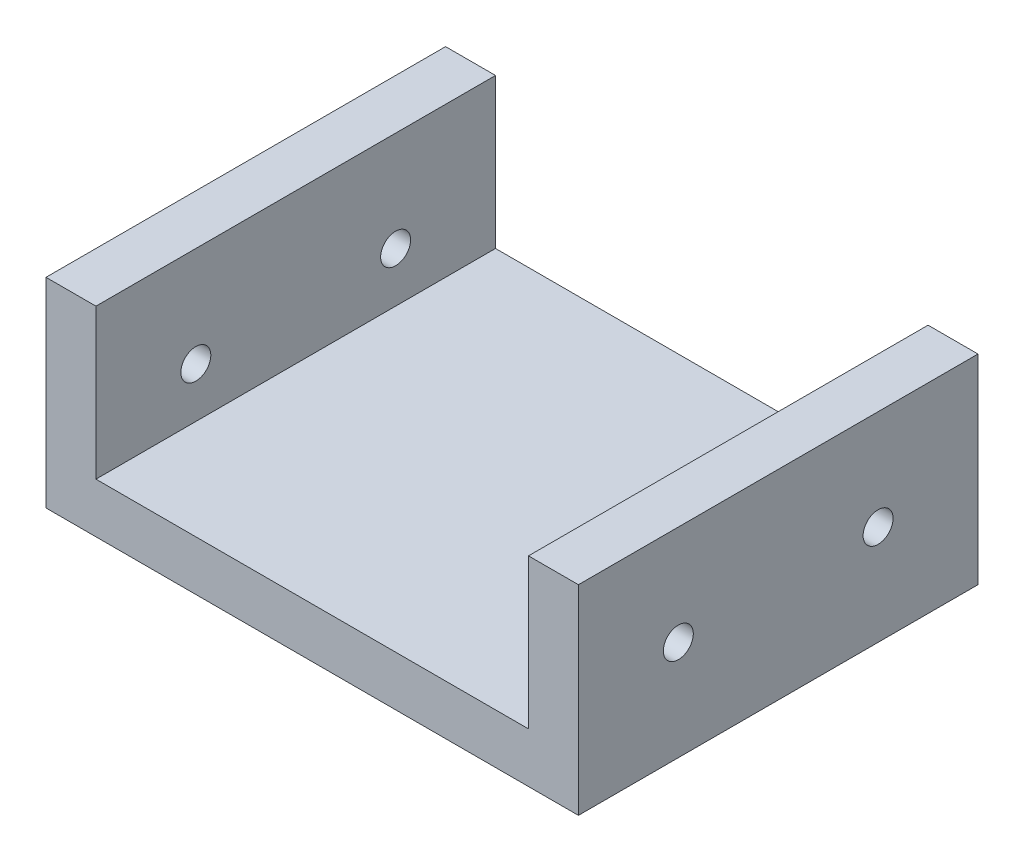
ISO-10303-21;
HEADER;
FILE_DESCRIPTION(('STEP AP214'),'2;1');
FILE_NAME('part.step','',(''),(''),'','','');
FILE_SCHEMA(('AUTOMOTIVE_DESIGN { 1 0 10303 214 1 1 1 1 }'));
ENDSEC;
DATA;
#1=APPLICATION_CONTEXT('core data for automotive mechanical design processes');
#2=APPLICATION_PROTOCOL_DEFINITION('international standard','automotive_design',2000,#1);
#3=PRODUCT_CONTEXT('',#1,'mechanical');
#4=PRODUCT('Part','Part','',(#3));
#5=PRODUCT_RELATED_PRODUCT_CATEGORY('part','',(#4));
#6=PRODUCT_DEFINITION_FORMATION('','',#4);
#7=PRODUCT_DEFINITION_CONTEXT('part definition',#1,'design');
#8=PRODUCT_DEFINITION('design','',#6,#7);
#9=PRODUCT_DEFINITION_SHAPE('','',#8);
#10=(LENGTH_UNIT() NAMED_UNIT(*) SI_UNIT(.MILLI.,.METRE.));
#11=(NAMED_UNIT(*) PLANE_ANGLE_UNIT() SI_UNIT($,.RADIAN.));
#12=(NAMED_UNIT(*) SI_UNIT($,.STERADIAN.) SOLID_ANGLE_UNIT());
#13=UNCERTAINTY_MEASURE_WITH_UNIT(LENGTH_MEASURE(1.E-05),#10,'distance_accuracy_value','');
#14=(GEOMETRIC_REPRESENTATION_CONTEXT(3) GLOBAL_UNCERTAINTY_ASSIGNED_CONTEXT((#13)) GLOBAL_UNIT_ASSIGNED_CONTEXT((#10,
#11,#12)) REPRESENTATION_CONTEXT('',''));
#15=CARTESIAN_POINT('',(0.,0.,0.));
#16=DIRECTION('',(0.,0.,1.));
#17=DIRECTION('',(1.,0.,0.));
#18=AXIS2_PLACEMENT_3D('',#15,#16,#17);
#19=CARTESIAN_POINT('',(0.,20.,0.));
#20=DIRECTION('',(0.,1.,0.));
#21=DIRECTION('',(0.,0.,1.));
#22=AXIS2_PLACEMENT_3D('',#19,#20,#21);
#23=PLANE('',#22);
#24=DIRECTION('',(0.,0.,1.));
#25=VECTOR('',#24,1.);
#26=CARTESIAN_POINT('',(5.,20.,0.));
#27=LINE('',#26,#25);
#28=CARTESIAN_POINT('',(5.,20.,0.));
#29=VERTEX_POINT('',#28);
#30=CARTESIAN_POINT('',(5.,20.,40.));
#31=VERTEX_POINT('',#30);
#32=EDGE_CURVE('E122',#29,#31,#27,.T.);
#33=ORIENTED_EDGE('',*,*,#32,.F.);
#34=DIRECTION('',(-1.,0.,0.));
#35=VECTOR('',#34,1.);
#36=CARTESIAN_POINT('',(0.,20.,0.));
#37=LINE('',#36,#35);
#38=CARTESIAN_POINT('',(0.,20.,0.));
#39=VERTEX_POINT('',#38);
#40=EDGE_CURVE('E67',#29,#39,#37,.T.);
#41=ORIENTED_EDGE('',*,*,#40,.T.);
#42=DIRECTION('',(0.,0.,1.));
#43=VECTOR('',#42,1.);
#44=CARTESIAN_POINT('',(0.,20.,0.));
#45=LINE('',#44,#43);
#46=CARTESIAN_POINT('',(0.,20.,40.));
#47=VERTEX_POINT('',#46);
#48=EDGE_CURVE('E153',#39,#47,#45,.T.);
#49=ORIENTED_EDGE('',*,*,#48,.T.);
#50=DIRECTION('',(1.,0.,0.));
#51=VECTOR('',#50,1.);
#52=CARTESIAN_POINT('',(0.,20.,40.));
#53=LINE('',#52,#51);
#54=EDGE_CURVE('E96',#47,#31,#53,.T.);
#55=ORIENTED_EDGE('',*,*,#54,.T.);
#56=EDGE_LOOP('',(#33,#41,#49,#55));
#57=FACE_BOUND('',#56,.T.);
#58=ADVANCED_FACE('F41',(#57),#23,.T.);
#59=CARTESIAN_POINT('',(0.,20.,0.));
#60=DIRECTION('',(1.,0.,0.));
#61=DIRECTION('',(0.,0.,-1.));
#62=AXIS2_PLACEMENT_3D('',#59,#60,#61);
#63=PLANE('',#62);
#64=CARTESIAN_POINT('',(0.,10.,30.));
#65=DIRECTION('',(1.,0.,0.));
#66=DIRECTION('',(0.,0.,-1.));
#67=AXIS2_PLACEMENT_3D('',#64,#65,#66);
#68=CIRCLE('',#67,1.5);
#69=CARTESIAN_POINT('',(0.,10.,28.5));
#70=VERTEX_POINT('',#69);
#71=EDGE_CURVE('E177',#70,#70,#68,.T.);
#72=ORIENTED_EDGE('',*,*,#71,.T.);
#73=EDGE_LOOP('',(#72));
#74=FACE_BOUND('',#73,.T.);
#75=CARTESIAN_POINT('',(0.,10.,10.));
#76=DIRECTION('',(1.,0.,0.));
#77=DIRECTION('',(0.,0.,1.));
#78=AXIS2_PLACEMENT_3D('',#75,#76,#77);
#79=CIRCLE('',#78,1.5);
#80=CARTESIAN_POINT('',(0.,10.,11.5));
#81=VERTEX_POINT('',#80);
#82=EDGE_CURVE('E193',#81,#81,#79,.T.);
#83=ORIENTED_EDGE('',*,*,#82,.T.);
#84=EDGE_LOOP('',(#83));
#85=FACE_BOUND('',#84,.T.);
#86=DIRECTION('',(0.,0.,1.));
#87=VECTOR('',#86,1.);
#88=CARTESIAN_POINT('',(0.,0.,0.));
#89=LINE('',#88,#87);
#90=CARTESIAN_POINT('',(0.,0.,0.));
#91=VERTEX_POINT('',#90);
#92=CARTESIAN_POINT('',(0.,0.,40.));
#93=VERTEX_POINT('',#92);
#94=EDGE_CURVE('E148',#91,#93,#89,.T.);
#95=ORIENTED_EDGE('',*,*,#94,.T.);
#96=DIRECTION('',(0.,-1.,0.));
#97=VECTOR('',#96,1.);
#98=CARTESIAN_POINT('',(0.,20.,40.));
#99=LINE('',#98,#97);
#100=EDGE_CURVE('E11',#47,#93,#99,.T.);
#101=ORIENTED_EDGE('',*,*,#100,.F.);
#102=ORIENTED_EDGE('',*,*,#48,.F.);
#103=DIRECTION('',(0.,-1.,0.));
#104=VECTOR('',#103,1.);
#105=CARTESIAN_POINT('',(0.,20.,0.));
#106=LINE('',#105,#104);
#107=EDGE_CURVE('E162',#39,#91,#106,.T.);
#108=ORIENTED_EDGE('',*,*,#107,.T.);
#109=EDGE_LOOP('',(#95,#101,#102,#108));
#110=FACE_BOUND('',#109,.T.);
#111=ADVANCED_FACE('F43',(#74,#85,#110),#63,.F.);
#112=CARTESIAN_POINT('',(0.,20.,40.));
#113=DIRECTION('',(0.,0.,-1.));
#114=DIRECTION('',(-1.,0.,0.));
#115=AXIS2_PLACEMENT_3D('',#112,#113,#114);
#116=PLANE('',#115);
#117=DIRECTION('',(1.,0.,0.));
#118=VECTOR('',#117,1.);
#119=CARTESIAN_POINT('',(5.,5.,40.));
#120=LINE('',#119,#118);
#121=CARTESIAN_POINT('',(5.,5.,40.));
#122=VERTEX_POINT('',#121);
#123=CARTESIAN_POINT('',(48.3,5.,40.));
#124=VERTEX_POINT('',#123);
#125=EDGE_CURVE('E130',#122,#124,#120,.T.);
#126=ORIENTED_EDGE('',*,*,#125,.F.);
#127=DIRECTION('',(0.,1.,0.));
#128=VECTOR('',#127,1.);
#129=CARTESIAN_POINT('',(5.,5.,40.));
#130=LINE('',#129,#128);
#131=EDGE_CURVE('E117',#122,#31,#130,.T.);
#132=ORIENTED_EDGE('',*,*,#131,.T.);
#133=ORIENTED_EDGE('',*,*,#54,.F.);
#134=ORIENTED_EDGE('',*,*,#100,.T.);
#135=DIRECTION('',(1.,0.,0.));
#136=VECTOR('',#135,1.);
#137=CARTESIAN_POINT('',(0.,0.,40.));
#138=LINE('',#137,#136);
#139=CARTESIAN_POINT('',(53.3,0.,40.));
#140=VERTEX_POINT('',#139);
#141=EDGE_CURVE('E165',#93,#140,#138,.T.);
#142=ORIENTED_EDGE('',*,*,#141,.T.);
#143=DIRECTION('',(0.,-1.,0.));
#144=VECTOR('',#143,1.);
#145=CARTESIAN_POINT('',(53.3,20.,40.));
#146=LINE('',#145,#144);
#147=CARTESIAN_POINT('',(53.3,20.,40.));
#148=VERTEX_POINT('',#147);
#149=EDGE_CURVE('E50',#148,#140,#146,.T.);
#150=ORIENTED_EDGE('',*,*,#149,.F.);
#151=CARTESIAN_POINT('',(48.3,20.,40.));
#152=VERTEX_POINT('',#151);
#153=EDGE_CURVE('E155',#152,#148,#53,.T.);
#154=ORIENTED_EDGE('',*,*,#153,.F.);
#155=DIRECTION('',(0.,1.,0.));
#156=VECTOR('',#155,1.);
#157=CARTESIAN_POINT('',(48.3,5.,40.));
#158=LINE('',#157,#156);
#159=EDGE_CURVE('E58',#124,#152,#158,.T.);
#160=ORIENTED_EDGE('',*,*,#159,.F.);
#161=EDGE_LOOP('',(#126,#132,#133,#134,#142,#150,#154,#160));
#162=FACE_BOUND('',#161,.T.);
#163=ADVANCED_FACE('F135',(#162),#116,.F.);
#164=CARTESIAN_POINT('',(53.3,20.,0.));
#165=DIRECTION('',(-1.,0.,0.));
#166=DIRECTION('',(0.,0.,1.));
#167=AXIS2_PLACEMENT_3D('',#164,#165,#166);
#168=PLANE('',#167);
#169=CARTESIAN_POINT('',(53.3,10.,30.));
#170=DIRECTION('',(1.,0.,0.));
#171=DIRECTION('',(0.,0.,-1.));
#172=AXIS2_PLACEMENT_3D('',#169,#170,#171);
#173=CIRCLE('',#172,1.5);
#174=CARTESIAN_POINT('',(53.3,10.,28.5));
#175=VERTEX_POINT('',#174);
#176=EDGE_CURVE('E183',#175,#175,#173,.T.);
#177=ORIENTED_EDGE('',*,*,#176,.F.);
#178=EDGE_LOOP('',(#177));
#179=FACE_BOUND('',#178,.T.);
#180=CARTESIAN_POINT('',(53.3,10.,10.));
#181=DIRECTION('',(1.,0.,0.));
#182=DIRECTION('',(0.,0.,1.));
#183=AXIS2_PLACEMENT_3D('',#180,#181,#182);
#184=CIRCLE('',#183,1.5);
#185=CARTESIAN_POINT('',(53.3,10.,11.5));
#186=VERTEX_POINT('',#185);
#187=EDGE_CURVE('E188',#186,#186,#184,.T.);
#188=ORIENTED_EDGE('',*,*,#187,.F.);
#189=EDGE_LOOP('',(#188));
#190=FACE_BOUND('',#189,.T.);
#191=DIRECTION('',(0.,0.,-1.));
#192=VECTOR('',#191,1.);
#193=CARTESIAN_POINT('',(53.3,0.,0.));
#194=LINE('',#193,#192);
#195=CARTESIAN_POINT('',(53.3,0.,0.));
#196=VERTEX_POINT('',#195);
#197=EDGE_CURVE('E167',#140,#196,#194,.T.);
#198=ORIENTED_EDGE('',*,*,#197,.T.);
#199=DIRECTION('',(0.,-1.,0.));
#200=VECTOR('',#199,1.);
#201=CARTESIAN_POINT('',(53.3,20.,0.));
#202=LINE('',#201,#200);
#203=CARTESIAN_POINT('',(53.3,20.,0.));
#204=VERTEX_POINT('',#203);
#205=EDGE_CURVE('E171',#204,#196,#202,.T.);
#206=ORIENTED_EDGE('',*,*,#205,.F.);
#207=DIRECTION('',(0.,0.,-1.));
#208=VECTOR('',#207,1.);
#209=CARTESIAN_POINT('',(53.3,20.,0.));
#210=LINE('',#209,#208);
#211=EDGE_CURVE('E157',#148,#204,#210,.T.);
#212=ORIENTED_EDGE('',*,*,#211,.F.);
#213=ORIENTED_EDGE('',*,*,#149,.T.);
#214=EDGE_LOOP('',(#198,#206,#212,#213));
#215=FACE_BOUND('',#214,.T.);
#216=ADVANCED_FACE('F238',(#179,#190,#215),#168,.F.);
#217=CARTESIAN_POINT('',(0.,20.,0.));
#218=DIRECTION('',(0.,0.,1.));
#219=DIRECTION('',(1.,0.,0.));
#220=AXIS2_PLACEMENT_3D('',#217,#218,#219);
#221=PLANE('',#220);
#222=ORIENTED_EDGE('',*,*,#40,.F.);
#223=DIRECTION('',(0.,1.,0.));
#224=VECTOR('',#223,1.);
#225=CARTESIAN_POINT('',(5.,5.,0.));
#226=LINE('',#225,#224);
#227=CARTESIAN_POINT('',(5.,5.,0.));
#228=VERTEX_POINT('',#227);
#229=EDGE_CURVE('E146',#228,#29,#226,.T.);
#230=ORIENTED_EDGE('',*,*,#229,.F.);
#231=DIRECTION('',(-1.,0.,0.));
#232=VECTOR('',#231,1.);
#233=CARTESIAN_POINT('',(5.,5.,0.));
#234=LINE('',#233,#232);
#235=CARTESIAN_POINT('',(48.3,5.,0.));
#236=VERTEX_POINT('',#235);
#237=EDGE_CURVE('E124',#236,#228,#234,.T.);
#238=ORIENTED_EDGE('',*,*,#237,.F.);
#239=DIRECTION('',(0.,1.,0.));
#240=VECTOR('',#239,1.);
#241=CARTESIAN_POINT('',(48.3,5.,0.));
#242=LINE('',#241,#240);
#243=CARTESIAN_POINT('',(48.3,20.,0.));
#244=VERTEX_POINT('',#243);
#245=EDGE_CURVE('E149',#236,#244,#242,.T.);
#246=ORIENTED_EDGE('',*,*,#245,.T.);
#247=EDGE_CURVE('E159',#204,#244,#37,.T.);
#248=ORIENTED_EDGE('',*,*,#247,.F.);
#249=ORIENTED_EDGE('',*,*,#205,.T.);
#250=DIRECTION('',(-1.,0.,0.));
#251=VECTOR('',#250,1.);
#252=CARTESIAN_POINT('',(0.,0.,0.));
#253=LINE('',#252,#251);
#254=EDGE_CURVE('E89',#196,#91,#253,.T.);
#255=ORIENTED_EDGE('',*,*,#254,.T.);
#256=ORIENTED_EDGE('',*,*,#107,.F.);
#257=EDGE_LOOP('',(#222,#230,#238,#246,#248,#249,#255,#256));
#258=FACE_BOUND('',#257,.T.);
#259=ADVANCED_FACE('F231',(#258),#221,.F.);
#260=DIRECTION('',(0.,0.,-1.));
#261=VECTOR('',#260,1.);
#262=CARTESIAN_POINT('',(48.3,20.,0.));
#263=LINE('',#262,#261);
#264=EDGE_CURVE('E133',#152,#244,#263,.T.);
#265=ORIENTED_EDGE('',*,*,#264,.F.);
#266=ORIENTED_EDGE('',*,*,#153,.T.);
#267=ORIENTED_EDGE('',*,*,#211,.T.);
#268=ORIENTED_EDGE('',*,*,#247,.T.);
#269=EDGE_LOOP('',(#265,#266,#267,#268));
#270=FACE_BOUND('',#269,.T.);
#271=ADVANCED_FACE('F221',(#270),#23,.T.);
#272=CARTESIAN_POINT('',(0.,0.,0.));
#273=DIRECTION('',(0.,1.,0.));
#274=DIRECTION('',(0.,0.,1.));
#275=AXIS2_PLACEMENT_3D('',#272,#273,#274);
#276=PLANE('',#275);
#277=ORIENTED_EDGE('',*,*,#94,.F.);
#278=ORIENTED_EDGE('',*,*,#254,.F.);
#279=ORIENTED_EDGE('',*,*,#197,.F.);
#280=ORIENTED_EDGE('',*,*,#141,.F.);
#281=EDGE_LOOP('',(#277,#278,#279,#280));
#282=FACE_BOUND('',#281,.T.);
#283=ADVANCED_FACE('F230',(#282),#276,.F.);
#284=CARTESIAN_POINT('',(5.,5.,0.));
#285=DIRECTION('',(-1.,0.,0.));
#286=DIRECTION('',(0.,0.,1.));
#287=AXIS2_PLACEMENT_3D('',#284,#285,#286);
#288=PLANE('',#287);
#289=CARTESIAN_POINT('',(5.,10.,30.));
#290=DIRECTION('',(-1.,0.,0.));
#291=DIRECTION('',(0.,0.,1.));
#292=AXIS2_PLACEMENT_3D('',#289,#290,#291);
#293=CIRCLE('',#292,1.5);
#294=CARTESIAN_POINT('',(5.,10.,31.5));
#295=VERTEX_POINT('',#294);
#296=EDGE_CURVE('E144',#295,#295,#293,.T.);
#297=ORIENTED_EDGE('',*,*,#296,.T.);
#298=EDGE_LOOP('',(#297));
#299=FACE_BOUND('',#298,.T.);
#300=CARTESIAN_POINT('',(5.,10.,10.));
#301=DIRECTION('',(-1.,0.,0.));
#302=DIRECTION('',(0.,0.,1.));
#303=AXIS2_PLACEMENT_3D('',#300,#301,#302);
#304=CIRCLE('',#303,1.5);
#305=CARTESIAN_POINT('',(5.,10.,11.5));
#306=VERTEX_POINT('',#305);
#307=EDGE_CURVE('E176',#306,#306,#304,.T.);
#308=ORIENTED_EDGE('',*,*,#307,.T.);
#309=EDGE_LOOP('',(#308));
#310=FACE_BOUND('',#309,.T.);
#311=ORIENTED_EDGE('',*,*,#32,.T.);
#312=ORIENTED_EDGE('',*,*,#131,.F.);
#313=DIRECTION('',(0.,0.,1.));
#314=VECTOR('',#313,1.);
#315=CARTESIAN_POINT('',(5.,5.,0.));
#316=LINE('',#315,#314);
#317=EDGE_CURVE('E120',#228,#122,#316,.T.);
#318=ORIENTED_EDGE('',*,*,#317,.F.);
#319=ORIENTED_EDGE('',*,*,#229,.T.);
#320=EDGE_LOOP('',(#311,#312,#318,#319));
#321=FACE_BOUND('',#320,.T.);
#322=ADVANCED_FACE('F119',(#299,#310,#321),#288,.F.);
#323=CARTESIAN_POINT('',(48.3,5.,0.));
#324=DIRECTION('',(1.,0.,0.));
#325=DIRECTION('',(0.,0.,-1.));
#326=AXIS2_PLACEMENT_3D('',#323,#324,#325);
#327=PLANE('',#326);
#328=CARTESIAN_POINT('',(48.3,10.,30.));
#329=DIRECTION('',(1.,0.,0.));
#330=DIRECTION('',(0.,0.,-1.));
#331=AXIS2_PLACEMENT_3D('',#328,#329,#330);
#332=CIRCLE('',#331,1.5);
#333=CARTESIAN_POINT('',(48.3,10.,28.5));
#334=VERTEX_POINT('',#333);
#335=EDGE_CURVE('E45',#334,#334,#332,.T.);
#336=ORIENTED_EDGE('',*,*,#335,.T.);
#337=EDGE_LOOP('',(#336));
#338=FACE_BOUND('',#337,.T.);
#339=CARTESIAN_POINT('',(48.3,10.,10.));
#340=DIRECTION('',(1.,0.,0.));
#341=DIRECTION('',(0.,0.,-1.));
#342=AXIS2_PLACEMENT_3D('',#339,#340,#341);
#343=CIRCLE('',#342,1.5);
#344=CARTESIAN_POINT('',(48.3,10.,8.5));
#345=VERTEX_POINT('',#344);
#346=EDGE_CURVE('E174',#345,#345,#343,.T.);
#347=ORIENTED_EDGE('',*,*,#346,.T.);
#348=EDGE_LOOP('',(#347));
#349=FACE_BOUND('',#348,.T.);
#350=ORIENTED_EDGE('',*,*,#264,.T.);
#351=ORIENTED_EDGE('',*,*,#245,.F.);
#352=DIRECTION('',(0.,0.,-1.));
#353=VECTOR('',#352,1.);
#354=CARTESIAN_POINT('',(48.3,5.,0.));
#355=LINE('',#354,#353);
#356=EDGE_CURVE('E137',#124,#236,#355,.T.);
#357=ORIENTED_EDGE('',*,*,#356,.F.);
#358=ORIENTED_EDGE('',*,*,#159,.T.);
#359=EDGE_LOOP('',(#350,#351,#357,#358));
#360=FACE_BOUND('',#359,.T.);
#361=ADVANCED_FACE('F201',(#338,#349,#360),#327,.F.);
#362=CARTESIAN_POINT('',(0.,5.,0.));
#363=DIRECTION('',(0.,1.,0.));
#364=DIRECTION('',(0.,0.,1.));
#365=AXIS2_PLACEMENT_3D('',#362,#363,#364);
#366=PLANE('',#365);
#367=ORIENTED_EDGE('',*,*,#317,.T.);
#368=ORIENTED_EDGE('',*,*,#125,.T.);
#369=ORIENTED_EDGE('',*,*,#356,.T.);
#370=ORIENTED_EDGE('',*,*,#237,.T.);
#371=EDGE_LOOP('',(#367,#368,#369,#370));
#372=FACE_BOUND('',#371,.T.);
#373=ADVANCED_FACE('F128',(#372),#366,.T.);
#374=CARTESIAN_POINT('',(0.,10.,10.));
#375=DIRECTION('',(1.,0.,0.));
#376=DIRECTION('',(0.,0.,-1.));
#377=AXIS2_PLACEMENT_3D('',#374,#375,#376);
#378=CYLINDRICAL_SURFACE('',#377,1.5);
#379=ORIENTED_EDGE('',*,*,#187,.T.);
#380=EDGE_LOOP('',(#379));
#381=FACE_BOUND('',#380,.T.);
#382=ORIENTED_EDGE('',*,*,#346,.F.);
#383=EDGE_LOOP('',(#382));
#384=FACE_BOUND('',#383,.T.);
#385=ADVANCED_FACE('F206',(#381,#384),#378,.F.);
#386=CARTESIAN_POINT('',(0.,10.,30.));
#387=DIRECTION('',(1.,0.,0.));
#388=DIRECTION('',(0.,0.,-1.));
#389=AXIS2_PLACEMENT_3D('',#386,#387,#388);
#390=CYLINDRICAL_SURFACE('',#389,1.5);
#391=ORIENTED_EDGE('',*,*,#176,.T.);
#392=EDGE_LOOP('',(#391));
#393=FACE_BOUND('',#392,.T.);
#394=ORIENTED_EDGE('',*,*,#335,.F.);
#395=EDGE_LOOP('',(#394));
#396=FACE_BOUND('',#395,.T.);
#397=ADVANCED_FACE('F203',(#393,#396),#390,.F.);
#398=ORIENTED_EDGE('',*,*,#82,.F.);
#399=EDGE_LOOP('',(#398));
#400=FACE_BOUND('',#399,.T.);
#401=ORIENTED_EDGE('',*,*,#307,.F.);
#402=EDGE_LOOP('',(#401));
#403=FACE_BOUND('',#402,.T.);
#404=ADVANCED_FACE('F205',(#400,#403),#378,.F.);
#405=ORIENTED_EDGE('',*,*,#71,.F.);
#406=EDGE_LOOP('',(#405));
#407=FACE_BOUND('',#406,.T.);
#408=ORIENTED_EDGE('',*,*,#296,.F.);
#409=EDGE_LOOP('',(#408));
#410=FACE_BOUND('',#409,.T.);
#411=ADVANCED_FACE('F209',(#407,#410),#390,.F.);
#412=CLOSED_SHELL('',(#58,#111,#163,#216,#259,#271,#283,#322,#361,#373,#385,#397,#404,#411));
#413=MANIFOLD_SOLID_BREP('B2',#412);
#414=ADVANCED_BREP_SHAPE_REPRESENTATION('',(#18,#413),#14);
#415=SHAPE_DEFINITION_REPRESENTATION(#9,#414);
ENDSEC;
END-ISO-10303-21;
